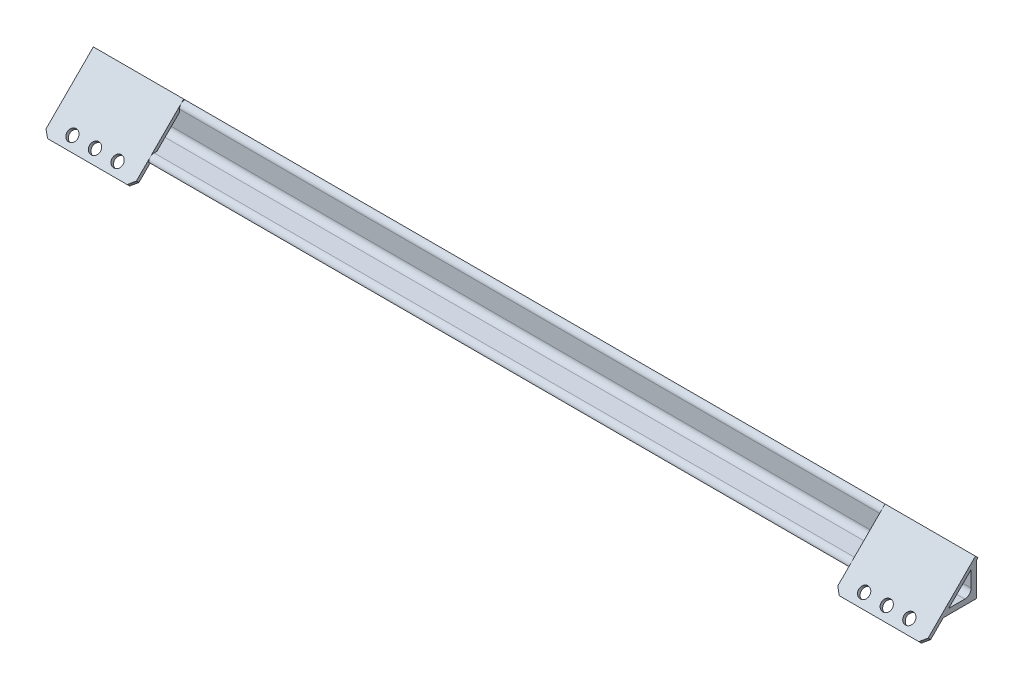
ISO-10303-21;
HEADER;
FILE_DESCRIPTION(('STEP AP214'),'2;1');
FILE_NAME('part.step','',(''),(''),'','','');
FILE_SCHEMA(('AUTOMOTIVE_DESIGN { 1 0 10303 214 1 1 1 1 }'));
ENDSEC;
DATA;
#1=APPLICATION_CONTEXT('core data for automotive mechanical design processes');
#2=APPLICATION_PROTOCOL_DEFINITION('international standard','automotive_design',2000,#1);
#3=PRODUCT_CONTEXT('',#1,'mechanical');
#4=PRODUCT('Part','Part','',(#3));
#5=PRODUCT_RELATED_PRODUCT_CATEGORY('part','',(#4));
#6=PRODUCT_DEFINITION_FORMATION('','',#4);
#7=PRODUCT_DEFINITION_CONTEXT('part definition',#1,'design');
#8=PRODUCT_DEFINITION('design','',#6,#7);
#9=PRODUCT_DEFINITION_SHAPE('','',#8);
#10=(LENGTH_UNIT() NAMED_UNIT(*) SI_UNIT(.MILLI.,.METRE.));
#11=(NAMED_UNIT(*) PLANE_ANGLE_UNIT() SI_UNIT($,.RADIAN.));
#12=(NAMED_UNIT(*) SI_UNIT($,.STERADIAN.) SOLID_ANGLE_UNIT());
#13=UNCERTAINTY_MEASURE_WITH_UNIT(LENGTH_MEASURE(1.E-05),#10,'distance_accuracy_value','');
#14=(GEOMETRIC_REPRESENTATION_CONTEXT(3) GLOBAL_UNCERTAINTY_ASSIGNED_CONTEXT((#13)) GLOBAL_UNIT_ASSIGNED_CONTEXT((#10,
#11,#12)) REPRESENTATION_CONTEXT('',''));
#15=CARTESIAN_POINT('',(0.,0.,0.));
#16=DIRECTION('',(0.,0.,1.));
#17=DIRECTION('',(1.,0.,0.));
#18=AXIS2_PLACEMENT_3D('',#15,#16,#17);
#19=CARTESIAN_POINT('',(-194.,19.2071067811865,-0.79289321881339));
#20=DIRECTION('',(1.,0.,0.));
#21=DIRECTION('',(0.,0.,-1.));
#22=AXIS2_PLACEMENT_3D('',#19,#20,#21);
#23=PLANE('',#22);
#24=DIRECTION('',(0.,0.707106781186547,-0.707106781186548));
#25=VECTOR('',#24,1.);
#26=CARTESIAN_POINT('',(-194.,20.6213203435596,0.621320343559705));
#27=LINE('',#26,#25);
#28=CARTESIAN_POINT('',(-194.,-5.57106781186553,26.8137084989848));
#29=VERTEX_POINT('',#28);
#30=CARTESIAN_POINT('',(-194.,20.6213203435596,0.621320343559705));
#31=VERTEX_POINT('',#30);
#32=EDGE_CURVE('E146',#29,#31,#27,.T.);
#33=ORIENTED_EDGE('',*,*,#32,.F.);
#34=DIRECTION('',(0.,-0.707106781186548,-0.707106781186547));
#35=VECTOR('',#34,1.);
#36=CARTESIAN_POINT('',(-194.,-6.98528137423862,25.3994949366117));
#37=LINE('',#36,#35);
#38=CARTESIAN_POINT('',(-194.,-6.98528137423862,25.3994949366117));
#39=VERTEX_POINT('',#38);
#40=EDGE_CURVE('E14',#29,#39,#37,.T.);
#41=ORIENTED_EDGE('',*,*,#40,.T.);
#42=DIRECTION('',(0.,0.707106781186547,-0.707106781186548));
#43=VECTOR('',#42,1.);
#44=CARTESIAN_POINT('',(-194.,19.2071067811865,-0.79289321881339));
#45=LINE('',#44,#43);
#46=CARTESIAN_POINT('',(-194.,19.2071067811865,-0.79289321881339));
#47=VERTEX_POINT('',#46);
#48=EDGE_CURVE('E121',#39,#47,#45,.T.);
#49=ORIENTED_EDGE('',*,*,#48,.T.);
#50=DIRECTION('',(0.,0.707106781186548,0.707106781186547));
#51=VECTOR('',#50,1.);
#52=CARTESIAN_POINT('',(-194.,19.2071067811865,-0.79289321881339));
#53=LINE('',#52,#51);
#54=EDGE_CURVE('E123',#47,#31,#53,.T.);
#55=ORIENTED_EDGE('',*,*,#54,.T.);
#56=EDGE_LOOP('',(#33,#41,#49,#55));
#57=FACE_BOUND('',#56,.T.);
#58=ADVANCED_FACE('F70',(#57),#23,.T.);
#59=CARTESIAN_POINT('',(-244.,-9.10660171779825,27.5208152801714));
#60=DIRECTION('',(0.,-0.707106781186547,0.707106781186548));
#61=DIRECTION('',(0.,-0.707106781186548,-0.707106781186547));
#62=AXIS2_PLACEMENT_3D('',#59,#60,#61);
#63=PLANE('',#62);
#64=DIRECTION('',(1.,0.,0.));
#65=VECTOR('',#64,1.);
#66=CARTESIAN_POINT('',(-244.,-7.69238815542516,28.9350288425445));
#67=LINE('',#66,#65);
#68=CARTESIAN_POINT('',(-241.,-7.69238815542516,28.9350288425445));
#69=VERTEX_POINT('',#68);
#70=CARTESIAN_POINT('',(-197.,-7.69238815542516,28.9350288425445));
#71=VERTEX_POINT('',#70);
#72=EDGE_CURVE('E127',#69,#71,#67,.T.);
#73=ORIENTED_EDGE('',*,*,#72,.F.);
#74=DIRECTION('',(0.,-0.707106781186548,-0.707106781186547));
#75=VECTOR('',#74,1.);
#76=CARTESIAN_POINT('',(-241.,-9.10660171779825,27.5208152801714));
#77=LINE('',#76,#75);
#78=CARTESIAN_POINT('',(-241.,-9.10660171779825,27.5208152801714));
#79=VERTEX_POINT('',#78);
#80=EDGE_CURVE('E166',#69,#79,#77,.T.);
#81=ORIENTED_EDGE('',*,*,#80,.T.);
#82=DIRECTION('',(1.,0.,0.));
#83=VECTOR('',#82,1.);
#84=CARTESIAN_POINT('',(-244.,-9.10660171779825,27.5208152801714));
#85=LINE('',#84,#83);
#86=CARTESIAN_POINT('',(-197.,-9.10660171779825,27.5208152801714));
#87=VERTEX_POINT('',#86);
#88=EDGE_CURVE('E135',#79,#87,#85,.T.);
#89=ORIENTED_EDGE('',*,*,#88,.T.);
#90=DIRECTION('',(0.,0.707106781186548,0.707106781186547));
#91=VECTOR('',#90,1.);
#92=CARTESIAN_POINT('',(-197.,-9.10660171779825,27.5208152801714));
#93=LINE('',#92,#91);
#94=EDGE_CURVE('E163',#87,#71,#93,.T.);
#95=ORIENTED_EDGE('',*,*,#94,.T.);
#96=EDGE_LOOP('',(#73,#81,#89,#95));
#97=FACE_BOUND('',#96,.T.);
#98=ADVANCED_FACE('F180',(#97),#63,.T.);
#99=CARTESIAN_POINT('',(-244.,19.2071067811865,-0.792893218813454));
#100=DIRECTION('',(-1.,0.,0.));
#101=DIRECTION('',(0.,0.,1.));
#102=AXIS2_PLACEMENT_3D('',#99,#100,#101);
#103=PLANE('',#102);
#104=DIRECTION('',(0.,-0.707106781186547,0.707106781186548));
#105=VECTOR('',#104,1.);
#106=CARTESIAN_POINT('',(-244.,19.2071067811865,-0.792893218813454));
#107=LINE('',#106,#105);
#108=CARTESIAN_POINT('',(-244.,19.2071067811865,-0.792893218813454));
#109=VERTEX_POINT('',#108);
#110=CARTESIAN_POINT('',(-244.,-6.98528137423861,25.3994949366117));
#111=VERTEX_POINT('',#110);
#112=EDGE_CURVE('E140',#109,#111,#107,.T.);
#113=ORIENTED_EDGE('',*,*,#112,.T.);
#114=DIRECTION('',(0.,0.707106781186548,0.707106781186547));
#115=VECTOR('',#114,1.);
#116=CARTESIAN_POINT('',(-244.,-6.98528137423861,25.3994949366117));
#117=LINE('',#116,#115);
#118=CARTESIAN_POINT('',(-244.,-5.57106781186552,26.8137084989848));
#119=VERTEX_POINT('',#118);
#120=EDGE_CURVE('E155',#111,#119,#117,.T.);
#121=ORIENTED_EDGE('',*,*,#120,.T.);
#122=DIRECTION('',(0.,-0.707106781186547,0.707106781186548));
#123=VECTOR('',#122,1.);
#124=CARTESIAN_POINT('',(-244.,20.6213203435596,0.621320343559641));
#125=LINE('',#124,#123);
#126=CARTESIAN_POINT('',(-244.,20.6213203435596,0.621320343559641));
#127=VERTEX_POINT('',#126);
#128=EDGE_CURVE('E150',#127,#119,#125,.T.);
#129=ORIENTED_EDGE('',*,*,#128,.F.);
#130=DIRECTION('',(0.,0.707106781186548,0.707106781186547));
#131=VECTOR('',#130,1.);
#132=CARTESIAN_POINT('',(-244.,19.2071067811865,-0.792893218813454));
#133=LINE('',#132,#131);
#134=EDGE_CURVE('E134',#109,#127,#133,.T.);
#135=ORIENTED_EDGE('',*,*,#134,.F.);
#136=EDGE_LOOP('',(#113,#121,#129,#135));
#137=FACE_BOUND('',#136,.T.);
#138=ADVANCED_FACE('F173',(#137),#103,.T.);
#139=CARTESIAN_POINT('',(-244.,19.2071067811865,-0.792893218813454));
#140=DIRECTION('',(0.,0.707106781186547,-0.707106781186548));
#141=DIRECTION('',(0.,0.707106781186548,0.707106781186547));
#142=AXIS2_PLACEMENT_3D('',#139,#140,#141);
#143=PLANE('',#142);
#144=DIRECTION('',(-1.,0.,0.));
#145=VECTOR('',#144,1.);
#146=CARTESIAN_POINT('',(-244.,20.6213203435596,0.621320343559641));
#147=LINE('',#146,#145);
#148=EDGE_CURVE('E133',#31,#127,#147,.T.);
#149=ORIENTED_EDGE('',*,*,#148,.F.);
#150=ORIENTED_EDGE('',*,*,#54,.F.);
#151=DIRECTION('',(-1.,0.,0.));
#152=VECTOR('',#151,1.);
#153=CARTESIAN_POINT('',(-244.,19.2071067811865,-0.792893218813454));
#154=LINE('',#153,#152);
#155=EDGE_CURVE('E126',#47,#109,#154,.T.);
#156=ORIENTED_EDGE('',*,*,#155,.T.);
#157=ORIENTED_EDGE('',*,*,#134,.T.);
#158=EDGE_LOOP('',(#149,#150,#156,#157));
#159=FACE_BOUND('',#158,.T.);
#160=ADVANCED_FACE('F131',(#159),#143,.T.);
#161=CARTESIAN_POINT('',(0.,9.20710678118655,9.20710678118655));
#162=DIRECTION('',(0.,0.707106781186548,0.707106781186547));
#163=DIRECTION('',(0.,-0.707106781186547,0.707106781186548));
#164=AXIS2_PLACEMENT_3D('',#161,#162,#163);
#165=PLANE('',#164);
#166=CARTESIAN_POINT('',(-231.5,-4.86396103067909,23.2781745930522));
#167=DIRECTION('',(0.,0.707106781186548,0.707106781186547));
#168=DIRECTION('',(0.,-0.707106781186547,0.707106781186548));
#169=AXIS2_PLACEMENT_3D('',#166,#167,#168);
#170=CIRCLE('',#169,2.99999999999999);
#171=CARTESIAN_POINT('',(-231.5,-6.98528137423873,25.3994949366118));
#172=VERTEX_POINT('',#171);
#173=EDGE_CURVE('E220',#172,#172,#170,.T.);
#174=ORIENTED_EDGE('',*,*,#173,.T.);
#175=EDGE_LOOP('',(#174));
#176=FACE_BOUND('',#175,.T.);
#177=CARTESIAN_POINT('',(-219.,-4.86396103067903,23.2781745930521));
#178=DIRECTION('',(0.,0.707106781186548,0.707106781186547));
#179=DIRECTION('',(0.,-0.707106781186547,0.707106781186548));
#180=AXIS2_PLACEMENT_3D('',#177,#178,#179);
#181=CIRCLE('',#180,3.);
#182=CARTESIAN_POINT('',(-219.,-6.98528137423867,25.3994949366118));
#183=VERTEX_POINT('',#182);
#184=EDGE_CURVE('E228',#183,#183,#181,.T.);
#185=ORIENTED_EDGE('',*,*,#184,.T.);
#186=EDGE_LOOP('',(#185));
#187=FACE_BOUND('',#186,.T.);
#188=CARTESIAN_POINT('',(-206.5,-4.86396103067897,23.2781745930521));
#189=DIRECTION('',(0.,0.707106781186548,0.707106781186547));
#190=DIRECTION('',(0.,-0.707106781186547,0.707106781186548));
#191=AXIS2_PLACEMENT_3D('',#188,#189,#190);
#192=CIRCLE('',#191,2.99999999999999);
#193=CARTESIAN_POINT('',(-206.5,-6.98528137423861,25.3994949366117));
#194=VERTEX_POINT('',#193);
#195=EDGE_CURVE('E148',#194,#194,#192,.T.);
#196=ORIENTED_EDGE('',*,*,#195,.T.);
#197=EDGE_LOOP('',(#196));
#198=FACE_BOUND('',#197,.T.);
#199=ORIENTED_EDGE('',*,*,#88,.F.);
#200=DIRECTION('',(0.707106781186547,-0.5,0.5));
#201=VECTOR('',#200,1.);
#202=CARTESIAN_POINT('',(-244.,-6.98528137423861,25.3994949366117));
#203=LINE('',#202,#201);
#204=EDGE_CURVE('E78',#79,#111,#203,.F.);
#205=ORIENTED_EDGE('',*,*,#204,.T.);
#206=ORIENTED_EDGE('',*,*,#112,.F.);
#207=ORIENTED_EDGE('',*,*,#155,.F.);
#208=ORIENTED_EDGE('',*,*,#48,.F.);
#209=DIRECTION('',(0.707106781186549,0.499999999999999,-0.499999999999999));
#210=VECTOR('',#209,1.);
#211=CARTESIAN_POINT('',(-197.,-9.10660171779825,27.5208152801714));
#212=LINE('',#211,#210);
#213=EDGE_CURVE('E90',#39,#87,#212,.F.);
#214=ORIENTED_EDGE('',*,*,#213,.T.);
#215=EDGE_LOOP('',(#199,#205,#206,#207,#208,#214));
#216=FACE_BOUND('',#215,.T.);
#217=ADVANCED_FACE('F138',(#176,#187,#198,#216),#165,.F.);
#218=CARTESIAN_POINT('',(0.,10.6213203435596,10.6213203435596));
#219=DIRECTION('',(0.,0.707106781186548,0.707106781186547));
#220=DIRECTION('',(0.,-0.707106781186547,0.707106781186548));
#221=AXIS2_PLACEMENT_3D('',#218,#219,#220);
#222=PLANE('',#221);
#223=CARTESIAN_POINT('',(-231.5,-3.449747468306,24.6923881554253));
#224=DIRECTION('',(0.,0.707106781186548,0.707106781186547));
#225=DIRECTION('',(0.,-0.707106781186547,0.707106781186548));
#226=AXIS2_PLACEMENT_3D('',#223,#224,#225);
#227=CIRCLE('',#226,2.99999999999999);
#228=CARTESIAN_POINT('',(-231.5,-5.57106781186564,26.8137084989849));
#229=VERTEX_POINT('',#228);
#230=EDGE_CURVE('E223',#229,#229,#227,.T.);
#231=ORIENTED_EDGE('',*,*,#230,.F.);
#232=EDGE_LOOP('',(#231));
#233=FACE_BOUND('',#232,.T.);
#234=CARTESIAN_POINT('',(-219.,-3.44974746830594,24.6923881554252));
#235=DIRECTION('',(0.,0.707106781186548,0.707106781186547));
#236=DIRECTION('',(0.,-0.707106781186547,0.707106781186548));
#237=AXIS2_PLACEMENT_3D('',#234,#235,#236);
#238=CIRCLE('',#237,3.);
#239=CARTESIAN_POINT('',(-219.,-5.57106781186558,26.8137084989849));
#240=VERTEX_POINT('',#239);
#241=EDGE_CURVE('E225',#240,#240,#238,.T.);
#242=ORIENTED_EDGE('',*,*,#241,.F.);
#243=EDGE_LOOP('',(#242));
#244=FACE_BOUND('',#243,.T.);
#245=CARTESIAN_POINT('',(-206.5,-3.44974746830587,24.6923881554252));
#246=DIRECTION('',(0.,0.707106781186548,0.707106781186547));
#247=DIRECTION('',(0.,-0.707106781186547,0.707106781186548));
#248=AXIS2_PLACEMENT_3D('',#245,#246,#247);
#249=CIRCLE('',#248,2.99999999999999);
#250=CARTESIAN_POINT('',(-206.5,-5.57106781186551,26.8137084989848));
#251=VERTEX_POINT('',#250);
#252=EDGE_CURVE('E231',#251,#251,#249,.T.);
#253=ORIENTED_EDGE('',*,*,#252,.F.);
#254=EDGE_LOOP('',(#253));
#255=FACE_BOUND('',#254,.T.);
#256=ORIENTED_EDGE('',*,*,#128,.T.);
#257=DIRECTION('',(-0.707106781186547,0.5,-0.5));
#258=VECTOR('',#257,1.);
#259=CARTESIAN_POINT('',(-133.449747468306,-83.7419010389117,104.984541726031));
#260=LINE('',#259,#258);
#261=EDGE_CURVE('E161',#119,#69,#260,.F.);
#262=ORIENTED_EDGE('',*,*,#261,.T.);
#263=ORIENTED_EDGE('',*,*,#72,.T.);
#264=DIRECTION('',(-0.707106781186549,-0.499999999999999,0.499999999999999));
#265=VECTOR('',#264,1.);
#266=CARTESIAN_POINT('',(-85.5502525316938,71.1144840409421,-49.8718433538229));
#267=LINE('',#266,#265);
#268=EDGE_CURVE('E159',#71,#29,#267,.F.);
#269=ORIENTED_EDGE('',*,*,#268,.T.);
#270=ORIENTED_EDGE('',*,*,#32,.T.);
#271=ORIENTED_EDGE('',*,*,#148,.T.);
#272=EDGE_LOOP('',(#256,#262,#263,#269,#270,#271));
#273=FACE_BOUND('',#272,.T.);
#274=ADVANCED_FACE('F178',(#233,#244,#255,#273),#222,.T.);
#275=CARTESIAN_POINT('',(-206.5,-4.86396103067897,23.2781745930521));
#276=DIRECTION('',(0.,0.707106781186548,0.707106781186547));
#277=DIRECTION('',(0.,-0.707106781186547,0.707106781186548));
#278=AXIS2_PLACEMENT_3D('',#275,#276,#277);
#279=CYLINDRICAL_SURFACE('',#278,2.99999999999999);
#280=ORIENTED_EDGE('',*,*,#195,.F.);
#281=EDGE_LOOP('',(#280));
#282=FACE_BOUND('',#281,.T.);
#283=ORIENTED_EDGE('',*,*,#252,.T.);
#284=EDGE_LOOP('',(#283));
#285=FACE_BOUND('',#284,.T.);
#286=ADVANCED_FACE('F201',(#282,#285),#279,.F.);
#287=CARTESIAN_POINT('',(-219.,-4.86396103067903,23.2781745930521));
#288=DIRECTION('',(0.,0.707106781186548,0.707106781186547));
#289=DIRECTION('',(0.,-0.707106781186547,0.707106781186548));
#290=AXIS2_PLACEMENT_3D('',#287,#288,#289);
#291=CYLINDRICAL_SURFACE('',#290,3.);
#292=ORIENTED_EDGE('',*,*,#184,.F.);
#293=EDGE_LOOP('',(#292));
#294=FACE_BOUND('',#293,.T.);
#295=ORIENTED_EDGE('',*,*,#241,.T.);
#296=EDGE_LOOP('',(#295));
#297=FACE_BOUND('',#296,.T.);
#298=ADVANCED_FACE('F208',(#294,#297),#291,.F.);
#299=CARTESIAN_POINT('',(-231.5,-4.86396103067909,23.2781745930522));
#300=DIRECTION('',(0.,0.707106781186548,0.707106781186547));
#301=DIRECTION('',(0.,-0.707106781186547,0.707106781186548));
#302=AXIS2_PLACEMENT_3D('',#299,#300,#301);
#303=CYLINDRICAL_SURFACE('',#302,2.99999999999999);
#304=ORIENTED_EDGE('',*,*,#173,.F.);
#305=EDGE_LOOP('',(#304));
#306=FACE_BOUND('',#305,.T.);
#307=ORIENTED_EDGE('',*,*,#230,.T.);
#308=EDGE_LOOP('',(#307));
#309=FACE_BOUND('',#308,.T.);
#310=ADVANCED_FACE('F187',(#306,#309),#303,.F.);
#311=CARTESIAN_POINT('',(-244.,-6.98528137423861,25.3994949366117));
#312=DIRECTION('',(0.707106781186548,0.5,-0.5));
#313=DIRECTION('',(0.,0.707106781186548,0.707106781186547));
#314=AXIS2_PLACEMENT_3D('',#311,#312,#313);
#315=PLANE('',#314);
#316=ORIENTED_EDGE('',*,*,#204,.F.);
#317=ORIENTED_EDGE('',*,*,#80,.F.);
#318=ORIENTED_EDGE('',*,*,#261,.F.);
#319=ORIENTED_EDGE('',*,*,#120,.F.);
#320=EDGE_LOOP('',(#316,#317,#318,#319));
#321=FACE_BOUND('',#320,.T.);
#322=ADVANCED_FACE('F175',(#321),#315,.F.);
#323=CARTESIAN_POINT('',(-197.,-9.10660171779825,27.5208152801714));
#324=DIRECTION('',(-0.707106781186546,0.500000000000001,-0.500000000000001));
#325=DIRECTION('',(0.,0.707106781186548,0.707106781186547));
#326=AXIS2_PLACEMENT_3D('',#323,#324,#325);
#327=PLANE('',#326);
#328=ORIENTED_EDGE('',*,*,#213,.F.);
#329=ORIENTED_EDGE('',*,*,#40,.F.);
#330=ORIENTED_EDGE('',*,*,#268,.F.);
#331=ORIENTED_EDGE('',*,*,#94,.F.);
#332=EDGE_LOOP('',(#328,#329,#330,#331));
#333=FACE_BOUND('',#332,.T.);
#334=ADVANCED_FACE('F72',(#333),#327,.F.);
#335=CLOSED_SHELL('',(#58,#98,#138,#160,#217,#274,#286,#298,#310,#322,#334));
#336=MANIFOLD_SOLID_BREP('B2',#335);
#337=CARTESIAN_POINT('',(244.,20.,0.));
#338=DIRECTION('',(0.,0.,1.));
#339=DIRECTION('',(1.,0.,0.));
#340=AXIS2_PLACEMENT_3D('',#337,#338,#339);
#341=PLANE('',#340);
#342=DIRECTION('',(-1.,0.,0.));
#343=VECTOR('',#342,1.);
#344=CARTESIAN_POINT('',(244.,20.,0.));
#345=LINE('',#344,#343);
#346=CARTESIAN_POINT('',(194.,20.,0.));
#347=VERTEX_POINT('',#346);
#348=CARTESIAN_POINT('',(-244.,20.,0.));
#349=VERTEX_POINT('',#348);
#350=EDGE_CURVE('E315',#347,#349,#345,.T.);
#351=ORIENTED_EDGE('',*,*,#350,.F.);
#352=DIRECTION('',(0.,-1.,0.));
#353=VECTOR('',#352,1.);
#354=CARTESIAN_POINT('',(194.,20.,0.));
#355=LINE('',#354,#353);
#356=CARTESIAN_POINT('',(194.,18.4142135623731,0.));
#357=VERTEX_POINT('',#356);
#358=EDGE_CURVE('E322',#347,#357,#355,.T.);
#359=ORIENTED_EDGE('',*,*,#358,.T.);
#360=DIRECTION('',(-1.,0.,0.));
#361=VECTOR('',#360,1.);
#362=CARTESIAN_POINT('',(244.,18.4142135623731,0.));
#363=LINE('',#362,#361);
#364=CARTESIAN_POINT('',(244.,18.4142135623731,0.));
#365=VERTEX_POINT('',#364);
#366=EDGE_CURVE('E519',#365,#357,#363,.T.);
#367=ORIENTED_EDGE('',*,*,#366,.F.);
#368=DIRECTION('',(0.,1.,0.));
#369=VECTOR('',#368,1.);
#370=CARTESIAN_POINT('',(244.,20.,0.));
#371=LINE('',#370,#369);
#372=CARTESIAN_POINT('',(244.,0.,0.));
#373=VERTEX_POINT('',#372);
#374=EDGE_CURVE('E531',#373,#365,#371,.T.);
#375=ORIENTED_EDGE('',*,*,#374,.F.);
#376=DIRECTION('',(-1.,0.,0.));
#377=VECTOR('',#376,1.);
#378=CARTESIAN_POINT('',(244.,0.,0.));
#379=LINE('',#378,#377);
#380=CARTESIAN_POINT('',(-244.,0.,0.));
#381=VERTEX_POINT('',#380);
#382=EDGE_CURVE('E544',#373,#381,#379,.T.);
#383=ORIENTED_EDGE('',*,*,#382,.T.);
#384=DIRECTION('',(0.,1.,0.));
#385=VECTOR('',#384,1.);
#386=CARTESIAN_POINT('',(-244.,20.,0.));
#387=LINE('',#386,#385);
#388=EDGE_CURVE('E530',#381,#349,#387,.T.);
#389=ORIENTED_EDGE('',*,*,#388,.T.);
#390=EDGE_LOOP('',(#351,#359,#367,#375,#383,#389));
#391=FACE_BOUND('',#390,.T.);
#392=ADVANCED_FACE('F308',(#391),#341,.F.);
#393=CARTESIAN_POINT('',(244.,17.,0.));
#394=DIRECTION('',(-1.,0.,0.));
#395=DIRECTION('',(0.,0.,1.));
#396=AXIS2_PLACEMENT_3D('',#393,#394,#395);
#397=CYLINDRICAL_SURFACE('',#396,3.);
#398=CARTESIAN_POINT('',(194.,17.,0.));
#399=DIRECTION('',(-1.,0.,0.));
#400=DIRECTION('',(0.,0.,1.));
#401=AXIS2_PLACEMENT_3D('',#398,#399,#400);
#402=CIRCLE('',#401,3.);
#403=CARTESIAN_POINT('',(194.,17.,3.));
#404=VERTEX_POINT('',#403);
#405=CARTESIAN_POINT('',(194.,19.1213203435596,2.12132034355964));
#406=VERTEX_POINT('',#405);
#407=EDGE_CURVE('E330',#404,#406,#402,.T.);
#408=ORIENTED_EDGE('',*,*,#407,.T.);
#409=EDGE_CURVE('E472',#406,#347,#402,.T.);
#410=ORIENTED_EDGE('',*,*,#409,.T.);
#411=ORIENTED_EDGE('',*,*,#350,.T.);
#412=CARTESIAN_POINT('',(-244.,17.,0.));
#413=DIRECTION('',(1.,0.,0.));
#414=DIRECTION('',(0.,0.,-1.));
#415=AXIS2_PLACEMENT_3D('',#412,#413,#414);
#416=CIRCLE('',#415,3.);
#417=CARTESIAN_POINT('',(-244.,17.,3.));
#418=VERTEX_POINT('',#417);
#419=EDGE_CURVE('E547',#349,#418,#416,.T.);
#420=ORIENTED_EDGE('',*,*,#419,.T.);
#421=DIRECTION('',(-1.,0.,0.));
#422=VECTOR('',#421,1.);
#423=CARTESIAN_POINT('',(244.,17.,3.));
#424=LINE('',#423,#422);
#425=EDGE_CURVE('E573',#404,#418,#424,.T.);
#426=ORIENTED_EDGE('',*,*,#425,.F.);
#427=EDGE_LOOP('',(#408,#410,#411,#420,#426));
#428=FACE_BOUND('',#427,.T.);
#429=ADVANCED_FACE('F575',(#428),#397,.T.);
#430=CARTESIAN_POINT('',(244.,6.5,3.));
#431=DIRECTION('',(0.,0.,-1.));
#432=DIRECTION('',(-1.,0.,0.));
#433=AXIS2_PLACEMENT_3D('',#430,#431,#432);
#434=PLANE('',#433);
#435=DIRECTION('',(1.,0.,0.));
#436=VECTOR('',#435,1.);
#437=CARTESIAN_POINT('',(244.,15.4142135623731,3.));
#438=LINE('',#437,#436);
#439=CARTESIAN_POINT('',(194.,15.4142135623731,3.));
#440=VERTEX_POINT('',#439);
#441=CARTESIAN_POINT('',(244.,15.4142135623731,2.99999999999999));
#442=VERTEX_POINT('',#441);
#443=EDGE_CURVE('E516',#440,#442,#438,.T.);
#444=ORIENTED_EDGE('',*,*,#443,.F.);
#445=DIRECTION('',(0.,1.,0.));
#446=VECTOR('',#445,1.);
#447=CARTESIAN_POINT('',(194.,6.5,3.));
#448=LINE('',#447,#446);
#449=EDGE_CURVE('E526',#440,#404,#448,.T.);
#450=ORIENTED_EDGE('',*,*,#449,.T.);
#451=ORIENTED_EDGE('',*,*,#425,.T.);
#452=DIRECTION('',(0.,-1.,0.));
#453=VECTOR('',#452,1.);
#454=CARTESIAN_POINT('',(-244.,6.5,3.));
#455=LINE('',#454,#453);
#456=CARTESIAN_POINT('',(-244.,6.5,3.));
#457=VERTEX_POINT('',#456);
#458=EDGE_CURVE('E550',#418,#457,#455,.T.);
#459=ORIENTED_EDGE('',*,*,#458,.T.);
#460=DIRECTION('',(-1.,0.,0.));
#461=VECTOR('',#460,1.);
#462=CARTESIAN_POINT('',(244.,6.5,3.));
#463=LINE('',#462,#461);
#464=CARTESIAN_POINT('',(244.,6.5,3.));
#465=VERTEX_POINT('',#464);
#466=EDGE_CURVE('E570',#465,#457,#463,.T.);
#467=ORIENTED_EDGE('',*,*,#466,.F.);
#468=DIRECTION('',(0.,-1.,0.));
#469=VECTOR('',#468,1.);
#470=CARTESIAN_POINT('',(244.,6.5,3.));
#471=LINE('',#470,#469);
#472=EDGE_CURVE('E534',#442,#465,#471,.T.);
#473=ORIENTED_EDGE('',*,*,#472,.F.);
#474=EDGE_LOOP('',(#444,#450,#451,#459,#467,#473));
#475=FACE_BOUND('',#474,.T.);
#476=ADVANCED_FACE('F603',(#475),#434,.F.);
#477=CARTESIAN_POINT('',(244.,6.5,6.5));
#478=DIRECTION('',(-1.,0.,0.));
#479=DIRECTION('',(0.,0.,1.));
#480=AXIS2_PLACEMENT_3D('',#477,#478,#479);
#481=CYLINDRICAL_SURFACE('',#480,3.5);
#482=CARTESIAN_POINT('',(-244.,6.5,6.5));
#483=DIRECTION('',(-1.,0.,0.));
#484=DIRECTION('',(0.,0.,1.));
#485=AXIS2_PLACEMENT_3D('',#482,#483,#484);
#486=CIRCLE('',#485,3.5);
#487=CARTESIAN_POINT('',(-244.,3.,6.5));
#488=VERTEX_POINT('',#487);
#489=EDGE_CURVE('E552',#457,#488,#486,.T.);
#490=ORIENTED_EDGE('',*,*,#489,.T.);
#491=DIRECTION('',(-1.,0.,0.));
#492=VECTOR('',#491,1.);
#493=CARTESIAN_POINT('',(244.,3.,6.5));
#494=LINE('',#493,#492);
#495=CARTESIAN_POINT('',(244.,3.,6.5));
#496=VERTEX_POINT('',#495);
#497=EDGE_CURVE('E567',#496,#488,#494,.T.);
#498=ORIENTED_EDGE('',*,*,#497,.F.);
#499=CARTESIAN_POINT('',(244.,6.5,6.5));
#500=DIRECTION('',(-1.,0.,0.));
#501=DIRECTION('',(0.,0.,1.));
#502=AXIS2_PLACEMENT_3D('',#499,#500,#501);
#503=CIRCLE('',#502,3.5);
#504=EDGE_CURVE('E537',#465,#496,#503,.T.);
#505=ORIENTED_EDGE('',*,*,#504,.F.);
#506=ORIENTED_EDGE('',*,*,#466,.T.);
#507=EDGE_LOOP('',(#490,#498,#505,#506));
#508=FACE_BOUND('',#507,.T.);
#509=ADVANCED_FACE('F600',(#508),#481,.F.);
#510=CARTESIAN_POINT('',(244.,3.,17.));
#511=DIRECTION('',(0.,-1.,0.));
#512=DIRECTION('',(0.,0.,-1.));
#513=AXIS2_PLACEMENT_3D('',#510,#511,#512);
#514=PLANE('',#513);
#515=DIRECTION('',(-1.,0.,0.));
#516=VECTOR('',#515,1.);
#517=CARTESIAN_POINT('',(244.,3.,17.));
#518=LINE('',#517,#516);
#519=CARTESIAN_POINT('',(194.,3.,17.));
#520=VERTEX_POINT('',#519);
#521=CARTESIAN_POINT('',(-244.,3.,17.));
#522=VERTEX_POINT('',#521);
#523=EDGE_CURVE('E565',#520,#522,#518,.T.);
#524=ORIENTED_EDGE('',*,*,#523,.F.);
#525=DIRECTION('',(0.,0.,-1.));
#526=VECTOR('',#525,1.);
#527=CARTESIAN_POINT('',(194.,3.,17.));
#528=LINE('',#527,#526);
#529=CARTESIAN_POINT('',(194.,3.,15.4142135623731));
#530=VERTEX_POINT('',#529);
#531=EDGE_CURVE('E524',#520,#530,#528,.T.);
#532=ORIENTED_EDGE('',*,*,#531,.T.);
#533=DIRECTION('',(-1.,0.,0.));
#534=VECTOR('',#533,1.);
#535=CARTESIAN_POINT('',(244.,3.,15.4142135623731));
#536=LINE('',#535,#534);
#537=CARTESIAN_POINT('',(244.,3.,15.4142135623731));
#538=VERTEX_POINT('',#537);
#539=EDGE_CURVE('E513',#538,#530,#536,.T.);
#540=ORIENTED_EDGE('',*,*,#539,.F.);
#541=DIRECTION('',(0.,0.,1.));
#542=VECTOR('',#541,1.);
#543=CARTESIAN_POINT('',(244.,3.,17.));
#544=LINE('',#543,#542);
#545=EDGE_CURVE('E539',#496,#538,#544,.T.);
#546=ORIENTED_EDGE('',*,*,#545,.F.);
#547=ORIENTED_EDGE('',*,*,#497,.T.);
#548=DIRECTION('',(0.,0.,1.));
#549=VECTOR('',#548,1.);
#550=CARTESIAN_POINT('',(-244.,3.,17.));
#551=LINE('',#550,#549);
#552=EDGE_CURVE('E554',#488,#522,#551,.T.);
#553=ORIENTED_EDGE('',*,*,#552,.T.);
#554=EDGE_LOOP('',(#524,#532,#540,#546,#547,#553));
#555=FACE_BOUND('',#554,.T.);
#556=ADVANCED_FACE('F595',(#555),#514,.F.);
#557=CARTESIAN_POINT('',(244.,0.,17.));
#558=DIRECTION('',(-1.,0.,0.));
#559=DIRECTION('',(0.,0.,1.));
#560=AXIS2_PLACEMENT_3D('',#557,#558,#559);
#561=CYLINDRICAL_SURFACE('',#560,3.);
#562=CARTESIAN_POINT('',(194.,0.,17.));
#563=DIRECTION('',(-1.,0.,0.));
#564=DIRECTION('',(0.,0.,1.));
#565=AXIS2_PLACEMENT_3D('',#562,#563,#564);
#566=CIRCLE('',#565,3.);
#567=CARTESIAN_POINT('',(194.,0.,20.));
#568=VERTEX_POINT('',#567);
#569=CARTESIAN_POINT('',(194.,2.12132034355964,19.1213203435596));
#570=VERTEX_POINT('',#569);
#571=EDGE_CURVE('E521',#568,#570,#566,.T.);
#572=ORIENTED_EDGE('',*,*,#571,.T.);
#573=EDGE_CURVE('E523',#570,#520,#566,.T.);
#574=ORIENTED_EDGE('',*,*,#573,.T.);
#575=ORIENTED_EDGE('',*,*,#523,.T.);
#576=CARTESIAN_POINT('',(-244.,0.,17.));
#577=DIRECTION('',(1.,0.,0.));
#578=DIRECTION('',(0.,0.,1.));
#579=AXIS2_PLACEMENT_3D('',#576,#577,#578);
#580=CIRCLE('',#579,3.);
#581=CARTESIAN_POINT('',(-244.,0.,20.));
#582=VERTEX_POINT('',#581);
#583=EDGE_CURVE('E557',#522,#582,#580,.T.);
#584=ORIENTED_EDGE('',*,*,#583,.T.);
#585=DIRECTION('',(-1.,0.,0.));
#586=VECTOR('',#585,1.);
#587=CARTESIAN_POINT('',(244.,0.,20.));
#588=LINE('',#587,#586);
#589=EDGE_CURVE('E563',#568,#582,#588,.T.);
#590=ORIENTED_EDGE('',*,*,#589,.F.);
#591=EDGE_LOOP('',(#572,#574,#575,#584,#590));
#592=FACE_BOUND('',#591,.T.);
#593=ADVANCED_FACE('F590',(#592),#561,.T.);
#594=CARTESIAN_POINT('',(244.,0.,0.));
#595=DIRECTION('',(0.,1.,0.));
#596=DIRECTION('',(0.,0.,1.));
#597=AXIS2_PLACEMENT_3D('',#594,#595,#596);
#598=PLANE('',#597);
#599=DIRECTION('',(1.,0.,0.));
#600=VECTOR('',#599,1.);
#601=CARTESIAN_POINT('',(244.,0.,18.4142135623731));
#602=LINE('',#601,#600);
#603=CARTESIAN_POINT('',(194.,0.,18.4142135623731));
#604=VERTEX_POINT('',#603);
#605=CARTESIAN_POINT('',(244.,0.,18.4142135623731));
#606=VERTEX_POINT('',#605);
#607=EDGE_CURVE('E444',#604,#606,#602,.T.);
#608=ORIENTED_EDGE('',*,*,#607,.F.);
#609=DIRECTION('',(0.,0.,1.));
#610=VECTOR('',#609,1.);
#611=CARTESIAN_POINT('',(194.,0.,0.));
#612=LINE('',#611,#610);
#613=EDGE_CURVE('E68',#604,#568,#612,.T.);
#614=ORIENTED_EDGE('',*,*,#613,.T.);
#615=ORIENTED_EDGE('',*,*,#589,.T.);
#616=DIRECTION('',(0.,0.,-1.));
#617=VECTOR('',#616,1.);
#618=CARTESIAN_POINT('',(-244.,0.,0.));
#619=LINE('',#618,#617);
#620=EDGE_CURVE('E535',#582,#381,#619,.T.);
#621=ORIENTED_EDGE('',*,*,#620,.T.);
#622=ORIENTED_EDGE('',*,*,#382,.F.);
#623=DIRECTION('',(0.,0.,-1.));
#624=VECTOR('',#623,1.);
#625=CARTESIAN_POINT('',(244.,0.,0.));
#626=LINE('',#625,#624);
#627=EDGE_CURVE('E542',#606,#373,#626,.T.);
#628=ORIENTED_EDGE('',*,*,#627,.F.);
#629=EDGE_LOOP('',(#608,#614,#615,#621,#622,#628));
#630=FACE_BOUND('',#629,.T.);
#631=ADVANCED_FACE('F585',(#630),#598,.F.);
#632=CARTESIAN_POINT('',(244.,0.,17.));
#633=DIRECTION('',(-1.,0.,0.));
#634=DIRECTION('',(0.,0.,1.));
#635=AXIS2_PLACEMENT_3D('',#632,#633,#634);
#636=PLANE('',#635);
#637=DIRECTION('',(0.,-0.707106781186547,0.707106781186548));
#638=VECTOR('',#637,1.);
#639=CARTESIAN_POINT('',(244.,19.2071067811865,-0.792893218813454));
#640=LINE('',#639,#638);
#641=EDGE_CURVE('E614',#442,#538,#640,.T.);
#642=ORIENTED_EDGE('',*,*,#641,.F.);
#643=ORIENTED_EDGE('',*,*,#472,.T.);
#644=ORIENTED_EDGE('',*,*,#504,.T.);
#645=ORIENTED_EDGE('',*,*,#545,.T.);
#646=EDGE_LOOP('',(#642,#643,#644,#645));
#647=FACE_BOUND('',#646,.T.);
#648=ORIENTED_EDGE('',*,*,#374,.T.);
#649=CARTESIAN_POINT('',(244.,19.2071067811865,-0.792893218813454));
#650=VERTEX_POINT('',#649);
#651=EDGE_CURVE('E616',#650,#365,#640,.T.);
#652=ORIENTED_EDGE('',*,*,#651,.F.);
#653=DIRECTION('',(0.,0.707106781186548,0.707106781186547));
#654=VECTOR('',#653,1.);
#655=CARTESIAN_POINT('',(244.,19.2071067811865,-0.792893218813454));
#656=LINE('',#655,#654);
#657=CARTESIAN_POINT('',(244.,20.6213203435596,0.621320343559641));
#658=VERTEX_POINT('',#657);
#659=EDGE_CURVE('E481',#650,#658,#656,.T.);
#660=ORIENTED_EDGE('',*,*,#659,.T.);
#661=DIRECTION('',(0.,-0.707106781186547,0.707106781186548));
#662=VECTOR('',#661,1.);
#663=CARTESIAN_POINT('',(244.,20.6213203435596,0.621320343559641));
#664=LINE('',#663,#662);
#665=CARTESIAN_POINT('',(244.,-5.57106781186552,26.8137084989848));
#666=VERTEX_POINT('',#665);
#667=EDGE_CURVE('E477',#658,#666,#664,.T.);
#668=ORIENTED_EDGE('',*,*,#667,.T.);
#669=DIRECTION('',(0.,0.707106781186548,0.707106781186547));
#670=VECTOR('',#669,1.);
#671=CARTESIAN_POINT('',(244.,-6.98528137423861,25.3994949366117));
#672=LINE('',#671,#670);
#673=CARTESIAN_POINT('',(244.,-6.98528137423861,25.3994949366117));
#674=VERTEX_POINT('',#673);
#675=EDGE_CURVE('E620',#674,#666,#672,.T.);
#676=ORIENTED_EDGE('',*,*,#675,.F.);
#677=EDGE_CURVE('E617',#606,#674,#640,.T.);
#678=ORIENTED_EDGE('',*,*,#677,.F.);
#679=ORIENTED_EDGE('',*,*,#627,.T.);
#680=EDGE_LOOP('',(#648,#652,#660,#668,#676,#678,#679));
#681=FACE_BOUND('',#680,.T.);
#682=ADVANCED_FACE('F627',(#647,#681),#636,.F.);
#683=CARTESIAN_POINT('',(-244.,0.,17.));
#684=DIRECTION('',(-1.,0.,0.));
#685=DIRECTION('',(0.,0.,1.));
#686=AXIS2_PLACEMENT_3D('',#683,#684,#685);
#687=PLANE('',#686);
#688=ORIENTED_EDGE('',*,*,#388,.F.);
#689=ORIENTED_EDGE('',*,*,#620,.F.);
#690=ORIENTED_EDGE('',*,*,#583,.F.);
#691=ORIENTED_EDGE('',*,*,#552,.F.);
#692=ORIENTED_EDGE('',*,*,#489,.F.);
#693=ORIENTED_EDGE('',*,*,#458,.F.);
#694=ORIENTED_EDGE('',*,*,#419,.F.);
#695=EDGE_LOOP('',(#688,#689,#690,#691,#692,#693,#694));
#696=FACE_BOUND('',#695,.T.);
#697=ADVANCED_FACE('F579',(#696),#687,.T.);
#698=CARTESIAN_POINT('',(244.,19.2071067811865,-0.792893218813454));
#699=DIRECTION('',(0.,0.707106781186547,-0.707106781186548));
#700=DIRECTION('',(0.,0.707106781186548,0.707106781186547));
#701=AXIS2_PLACEMENT_3D('',#698,#699,#700);
#702=PLANE('',#701);
#703=DIRECTION('',(1.,0.,0.));
#704=VECTOR('',#703,1.);
#705=CARTESIAN_POINT('',(244.,20.6213203435596,0.621320343559641));
#706=LINE('',#705,#704);
#707=CARTESIAN_POINT('',(194.,20.6213203435596,0.621320343559705));
#708=VERTEX_POINT('',#707);
#709=EDGE_CURVE('E475',#708,#658,#706,.T.);
#710=ORIENTED_EDGE('',*,*,#709,.T.);
#711=ORIENTED_EDGE('',*,*,#659,.F.);
#712=DIRECTION('',(1.,0.,0.));
#713=VECTOR('',#712,1.);
#714=CARTESIAN_POINT('',(244.,19.2071067811865,-0.792893218813454));
#715=LINE('',#714,#713);
#716=CARTESIAN_POINT('',(194.,19.2071067811865,-0.79289321881339));
#717=VERTEX_POINT('',#716);
#718=EDGE_CURVE('E480',#717,#650,#715,.T.);
#719=ORIENTED_EDGE('',*,*,#718,.F.);
#720=DIRECTION('',(0.,0.707106781186548,0.707106781186547));
#721=VECTOR('',#720,1.);
#722=CARTESIAN_POINT('',(194.,19.2071067811865,-0.79289321881339));
#723=LINE('',#722,#721);
#724=EDGE_CURVE('E877',#717,#347,#723,.T.);
#725=ORIENTED_EDGE('',*,*,#724,.T.);
#726=EDGE_CURVE('E470',#347,#708,#723,.T.);
#727=ORIENTED_EDGE('',*,*,#726,.T.);
#728=EDGE_LOOP('',(#710,#711,#719,#725,#727));
#729=FACE_BOUND('',#728,.T.);
#730=ADVANCED_FACE('F646',(#729),#702,.T.);
#731=CARTESIAN_POINT('',(194.,19.2071067811865,-0.79289321881339));
#732=DIRECTION('',(-1.,0.,0.));
#733=DIRECTION('',(0.,0.,-1.));
#734=AXIS2_PLACEMENT_3D('',#731,#732,#733);
#735=PLANE('',#734);
#736=ORIENTED_EDGE('',*,*,#358,.F.);
#737=ORIENTED_EDGE('',*,*,#724,.F.);
#738=DIRECTION('',(0.,0.707106781186547,-0.707106781186548));
#739=VECTOR('',#738,1.);
#740=CARTESIAN_POINT('',(194.,19.2071067811865,-0.79289321881339));
#741=LINE('',#740,#739);
#742=EDGE_CURVE('E455',#357,#717,#741,.T.);
#743=ORIENTED_EDGE('',*,*,#742,.F.);
#744=EDGE_LOOP('',(#736,#737,#743));
#745=FACE_BOUND('',#744,.T.);
#746=ADVANCED_FACE('F648',(#745),#735,.T.);
#747=ORIENTED_EDGE('',*,*,#409,.F.);
#748=DIRECTION('',(0.,0.707106781186547,-0.707106781186548));
#749=VECTOR('',#748,1.);
#750=CARTESIAN_POINT('',(194.,20.6213203435596,0.621320343559705));
#751=LINE('',#750,#749);
#752=EDGE_CURVE('E464',#406,#708,#751,.T.);
#753=ORIENTED_EDGE('',*,*,#752,.T.);
#754=ORIENTED_EDGE('',*,*,#726,.F.);
#755=EDGE_LOOP('',(#747,#753,#754));
#756=FACE_BOUND('',#755,.T.);
#757=ADVANCED_FACE('F469',(#756),#735,.T.);
#758=ORIENTED_EDGE('',*,*,#407,.F.);
#759=ORIENTED_EDGE('',*,*,#449,.F.);
#760=EDGE_CURVE('E609',#530,#440,#741,.T.);
#761=ORIENTED_EDGE('',*,*,#760,.F.);
#762=ORIENTED_EDGE('',*,*,#531,.F.);
#763=ORIENTED_EDGE('',*,*,#573,.F.);
#764=EDGE_CURVE('E462',#570,#406,#751,.T.);
#765=ORIENTED_EDGE('',*,*,#764,.T.);
#766=EDGE_LOOP('',(#758,#759,#761,#762,#763,#765));
#767=FACE_BOUND('',#766,.T.);
#768=ADVANCED_FACE('F606',(#767),#735,.T.);
#769=ORIENTED_EDGE('',*,*,#571,.F.);
#770=ORIENTED_EDGE('',*,*,#613,.F.);
#771=CARTESIAN_POINT('',(194.,-6.98528137423862,25.3994949366117));
#772=VERTEX_POINT('',#771);
#773=EDGE_CURVE('E454',#772,#604,#741,.T.);
#774=ORIENTED_EDGE('',*,*,#773,.F.);
#775=DIRECTION('',(0.,-0.707106781186548,-0.707106781186547));
#776=VECTOR('',#775,1.);
#777=CARTESIAN_POINT('',(194.,-6.98528137423862,25.3994949366117));
#778=LINE('',#777,#776);
#779=CARTESIAN_POINT('',(194.,-5.57106781186553,26.8137084989848));
#780=VERTEX_POINT('',#779);
#781=EDGE_CURVE('E436',#780,#772,#778,.T.);
#782=ORIENTED_EDGE('',*,*,#781,.F.);
#783=EDGE_CURVE('E451',#780,#570,#751,.T.);
#784=ORIENTED_EDGE('',*,*,#783,.T.);
#785=EDGE_LOOP('',(#769,#770,#774,#782,#784));
#786=FACE_BOUND('',#785,.T.);
#787=ADVANCED_FACE('F450',(#786),#735,.T.);
#788=CARTESIAN_POINT('',(0.,9.20710678118655,9.20710678118655));
#789=DIRECTION('',(0.,0.707106781186548,0.707106781186547));
#790=DIRECTION('',(0.,-0.707106781186547,0.707106781186548));
#791=AXIS2_PLACEMENT_3D('',#788,#789,#790);
#792=PLANE('',#791);
#793=ORIENTED_EDGE('',*,*,#651,.T.);
#794=ORIENTED_EDGE('',*,*,#366,.T.);
#795=ORIENTED_EDGE('',*,*,#742,.T.);
#796=ORIENTED_EDGE('',*,*,#718,.T.);
#797=EDGE_LOOP('',(#793,#794,#795,#796));
#798=FACE_BOUND('',#797,.T.);
#799=ADVANCED_FACE('F642',(#798),#792,.F.);
#800=ORIENTED_EDGE('',*,*,#760,.T.);
#801=ORIENTED_EDGE('',*,*,#443,.T.);
#802=ORIENTED_EDGE('',*,*,#641,.T.);
#803=ORIENTED_EDGE('',*,*,#539,.T.);
#804=EDGE_LOOP('',(#800,#801,#802,#803));
#805=FACE_BOUND('',#804,.T.);
#806=ADVANCED_FACE('F612',(#805),#792,.F.);
#807=CARTESIAN_POINT('',(231.5,-4.86396103067909,23.2781745930522));
#808=DIRECTION('',(0.,-0.707106781186548,-0.707106781186547));
#809=DIRECTION('',(0.,-0.707106781186547,0.707106781186548));
#810=AXIS2_PLACEMENT_3D('',#807,#808,#809);
#811=CIRCLE('',#810,2.99999999999999);
#812=CARTESIAN_POINT('',(231.5,-6.98528137423873,25.3994949366118));
#813=VERTEX_POINT('',#812);
#814=EDGE_CURVE('E483',#813,#813,#811,.T.);
#815=ORIENTED_EDGE('',*,*,#814,.F.);
#816=EDGE_LOOP('',(#815));
#817=FACE_BOUND('',#816,.T.);
#818=CARTESIAN_POINT('',(219.,-4.86396103067903,23.2781745930521));
#819=DIRECTION('',(0.,-0.707106781186548,-0.707106781186547));
#820=DIRECTION('',(0.,-0.707106781186547,0.707106781186548));
#821=AXIS2_PLACEMENT_3D('',#818,#819,#820);
#822=CIRCLE('',#821,3.);
#823=CARTESIAN_POINT('',(219.,-6.98528137423867,25.3994949366118));
#824=VERTEX_POINT('',#823);
#825=EDGE_CURVE('E490',#824,#824,#822,.T.);
#826=ORIENTED_EDGE('',*,*,#825,.F.);
#827=EDGE_LOOP('',(#826));
#828=FACE_BOUND('',#827,.T.);
#829=CARTESIAN_POINT('',(206.5,-4.86396103067897,23.2781745930521));
#830=DIRECTION('',(0.,-0.707106781186548,-0.707106781186547));
#831=DIRECTION('',(0.,-0.707106781186547,0.707106781186548));
#832=AXIS2_PLACEMENT_3D('',#829,#830,#831);
#833=CIRCLE('',#832,2.99999999999999);
#834=CARTESIAN_POINT('',(206.5,-6.98528137423861,25.3994949366117));
#835=VERTEX_POINT('',#834);
#836=EDGE_CURVE('E493',#835,#835,#833,.T.);
#837=ORIENTED_EDGE('',*,*,#836,.F.);
#838=EDGE_LOOP('',(#837));
#839=FACE_BOUND('',#838,.T.);
#840=ORIENTED_EDGE('',*,*,#773,.T.);
#841=ORIENTED_EDGE('',*,*,#607,.T.);
#842=ORIENTED_EDGE('',*,*,#677,.T.);
#843=DIRECTION('',(-0.707106781186547,-0.5,0.5));
#844=VECTOR('',#843,1.);
#845=CARTESIAN_POINT('',(244.,-6.98528137423861,25.3994949366117));
#846=LINE('',#845,#844);
#847=CARTESIAN_POINT('',(241.,-9.10660171779825,27.5208152801714));
#848=VERTEX_POINT('',#847);
#849=EDGE_CURVE('E496',#848,#674,#846,.F.);
#850=ORIENTED_EDGE('',*,*,#849,.F.);
#851=DIRECTION('',(-1.,0.,0.));
#852=VECTOR('',#851,1.);
#853=CARTESIAN_POINT('',(244.,-9.10660171779825,27.5208152801714));
#854=LINE('',#853,#852);
#855=CARTESIAN_POINT('',(197.,-9.10660171779825,27.5208152801714));
#856=VERTEX_POINT('',#855);
#857=EDGE_CURVE('E640',#848,#856,#854,.T.);
#858=ORIENTED_EDGE('',*,*,#857,.T.);
#859=DIRECTION('',(-0.707106781186549,0.499999999999999,-0.499999999999999));
#860=VECTOR('',#859,1.);
#861=CARTESIAN_POINT('',(197.,-9.10660171779825,27.5208152801714));
#862=LINE('',#861,#860);
#863=EDGE_CURVE('E499',#772,#856,#862,.F.);
#864=ORIENTED_EDGE('',*,*,#863,.F.);
#865=EDGE_LOOP('',(#840,#841,#842,#850,#858,#864));
#866=FACE_BOUND('',#865,.T.);
#867=ADVANCED_FACE('F639',(#817,#828,#839,#866),#792,.F.);
#868=CARTESIAN_POINT('',(0.,10.6213203435596,10.6213203435596));
#869=DIRECTION('',(0.,0.707106781186548,0.707106781186547));
#870=DIRECTION('',(0.,-0.707106781186547,0.707106781186548));
#871=AXIS2_PLACEMENT_3D('',#868,#869,#870);
#872=PLANE('',#871);
#873=ORIENTED_EDGE('',*,*,#752,.F.);
#874=ORIENTED_EDGE('',*,*,#764,.F.);
#875=ORIENTED_EDGE('',*,*,#783,.F.);
#876=DIRECTION('',(0.707106781186549,-0.499999999999999,0.499999999999999));
#877=VECTOR('',#876,1.);
#878=CARTESIAN_POINT('',(85.5502525316938,71.1144840409421,-49.8718433538229));
#879=LINE('',#878,#877);
#880=CARTESIAN_POINT('',(197.,-7.69238815542516,28.9350288425445));
#881=VERTEX_POINT('',#880);
#882=EDGE_CURVE('E433',#881,#780,#879,.F.);
#883=ORIENTED_EDGE('',*,*,#882,.F.);
#884=DIRECTION('',(-1.,0.,0.));
#885=VECTOR('',#884,1.);
#886=CARTESIAN_POINT('',(244.,-7.69238815542516,28.9350288425445));
#887=LINE('',#886,#885);
#888=CARTESIAN_POINT('',(241.,-7.69238815542516,28.9350288425445));
#889=VERTEX_POINT('',#888);
#890=EDGE_CURVE('E630',#889,#881,#887,.T.);
#891=ORIENTED_EDGE('',*,*,#890,.F.);
#892=DIRECTION('',(0.707106781186547,0.5,-0.5));
#893=VECTOR('',#892,1.);
#894=CARTESIAN_POINT('',(133.449747468306,-83.7419010389117,104.984541726031));
#895=LINE('',#894,#893);
#896=EDGE_CURVE('E445',#666,#889,#895,.F.);
#897=ORIENTED_EDGE('',*,*,#896,.F.);
#898=ORIENTED_EDGE('',*,*,#667,.F.);
#899=ORIENTED_EDGE('',*,*,#709,.F.);
#900=EDGE_LOOP('',(#873,#874,#875,#883,#891,#897,#898,#899));
#901=FACE_BOUND('',#900,.T.);
#902=CARTESIAN_POINT('',(231.5,-3.449747468306,24.6923881554253));
#903=DIRECTION('',(0.,-0.707106781186548,-0.707106781186547));
#904=DIRECTION('',(0.,-0.707106781186547,0.707106781186548));
#905=AXIS2_PLACEMENT_3D('',#902,#903,#904);
#906=CIRCLE('',#905,2.99999999999999);
#907=CARTESIAN_POINT('',(231.5,-5.57106781186564,26.8137084989849));
#908=VERTEX_POINT('',#907);
#909=EDGE_CURVE('E501',#908,#908,#906,.T.);
#910=ORIENTED_EDGE('',*,*,#909,.T.);
#911=EDGE_LOOP('',(#910));
#912=FACE_BOUND('',#911,.T.);
#913=CARTESIAN_POINT('',(219.,-3.44974746830594,24.6923881554252));
#914=DIRECTION('',(0.,-0.707106781186548,-0.707106781186547));
#915=DIRECTION('',(0.,-0.707106781186547,0.707106781186548));
#916=AXIS2_PLACEMENT_3D('',#913,#914,#915);
#917=CIRCLE('',#916,3.);
#918=CARTESIAN_POINT('',(219.,-5.57106781186558,26.8137084989849));
#919=VERTEX_POINT('',#918);
#920=EDGE_CURVE('E504',#919,#919,#917,.T.);
#921=ORIENTED_EDGE('',*,*,#920,.T.);
#922=EDGE_LOOP('',(#921));
#923=FACE_BOUND('',#922,.T.);
#924=CARTESIAN_POINT('',(206.5,-3.44974746830587,24.6923881554252));
#925=DIRECTION('',(0.,-0.707106781186548,-0.707106781186547));
#926=DIRECTION('',(0.,-0.707106781186547,0.707106781186548));
#927=AXIS2_PLACEMENT_3D('',#924,#925,#926);
#928=CIRCLE('',#927,2.99999999999999);
#929=CARTESIAN_POINT('',(206.5,-5.57106781186551,26.8137084989848));
#930=VERTEX_POINT('',#929);
#931=EDGE_CURVE('E507',#930,#930,#928,.T.);
#932=ORIENTED_EDGE('',*,*,#931,.T.);
#933=EDGE_LOOP('',(#932));
#934=FACE_BOUND('',#933,.T.);
#935=ADVANCED_FACE('F459',(#901,#912,#923,#934),#872,.T.);
#936=CARTESIAN_POINT('',(244.,-9.10660171779825,27.5208152801714));
#937=DIRECTION('',(0.,-0.707106781186547,0.707106781186548));
#938=DIRECTION('',(0.,-0.707106781186548,-0.707106781186547));
#939=AXIS2_PLACEMENT_3D('',#936,#937,#938);
#940=PLANE('',#939);
#941=ORIENTED_EDGE('',*,*,#890,.T.);
#942=DIRECTION('',(0.,0.707106781186548,0.707106781186547));
#943=VECTOR('',#942,1.);
#944=CARTESIAN_POINT('',(197.,-9.10660171779825,27.5208152801714));
#945=LINE('',#944,#943);
#946=EDGE_CURVE('E439',#856,#881,#945,.T.);
#947=ORIENTED_EDGE('',*,*,#946,.F.);
#948=ORIENTED_EDGE('',*,*,#857,.F.);
#949=DIRECTION('',(0.,-0.707106781186548,-0.707106781186547));
#950=VECTOR('',#949,1.);
#951=CARTESIAN_POINT('',(241.,-9.10660171779825,27.5208152801714));
#952=LINE('',#951,#950);
#953=EDGE_CURVE('E635',#889,#848,#952,.T.);
#954=ORIENTED_EDGE('',*,*,#953,.F.);
#955=EDGE_LOOP('',(#941,#947,#948,#954));
#956=FACE_BOUND('',#955,.T.);
#957=ADVANCED_FACE('F693',(#956),#940,.T.);
#958=CARTESIAN_POINT('',(206.5,-4.86396103067897,23.2781745930521));
#959=DIRECTION('',(0.,0.707106781186548,0.707106781186547));
#960=DIRECTION('',(0.,-0.707106781186547,0.707106781186548));
#961=AXIS2_PLACEMENT_3D('',#958,#959,#960);
#962=CYLINDRICAL_SURFACE('',#961,2.99999999999999);
#963=ORIENTED_EDGE('',*,*,#836,.T.);
#964=EDGE_LOOP('',(#963));
#965=FACE_BOUND('',#964,.T.);
#966=ORIENTED_EDGE('',*,*,#931,.F.);
#967=EDGE_LOOP('',(#966));
#968=FACE_BOUND('',#967,.T.);
#969=ADVANCED_FACE('F689',(#965,#968),#962,.F.);
#970=CARTESIAN_POINT('',(219.,-4.86396103067903,23.2781745930521));
#971=DIRECTION('',(0.,0.707106781186548,0.707106781186547));
#972=DIRECTION('',(0.,-0.707106781186547,0.707106781186548));
#973=AXIS2_PLACEMENT_3D('',#970,#971,#972);
#974=CYLINDRICAL_SURFACE('',#973,3.);
#975=ORIENTED_EDGE('',*,*,#825,.T.);
#976=EDGE_LOOP('',(#975));
#977=FACE_BOUND('',#976,.T.);
#978=ORIENTED_EDGE('',*,*,#920,.F.);
#979=EDGE_LOOP('',(#978));
#980=FACE_BOUND('',#979,.T.);
#981=ADVANCED_FACE('F685',(#977,#980),#974,.F.);
#982=CARTESIAN_POINT('',(231.5,-4.86396103067909,23.2781745930522));
#983=DIRECTION('',(0.,0.707106781186548,0.707106781186547));
#984=DIRECTION('',(0.,-0.707106781186547,0.707106781186548));
#985=AXIS2_PLACEMENT_3D('',#982,#983,#984);
#986=CYLINDRICAL_SURFACE('',#985,2.99999999999999);
#987=ORIENTED_EDGE('',*,*,#814,.T.);
#988=EDGE_LOOP('',(#987));
#989=FACE_BOUND('',#988,.T.);
#990=ORIENTED_EDGE('',*,*,#909,.F.);
#991=EDGE_LOOP('',(#990));
#992=FACE_BOUND('',#991,.T.);
#993=ADVANCED_FACE('F682',(#989,#992),#986,.F.);
#994=CARTESIAN_POINT('',(244.,-6.98528137423861,25.3994949366117));
#995=DIRECTION('',(-0.707106781186548,0.5,-0.5));
#996=DIRECTION('',(0.,0.707106781186548,0.707106781186547));
#997=AXIS2_PLACEMENT_3D('',#994,#995,#996);
#998=PLANE('',#997);
#999=ORIENTED_EDGE('',*,*,#849,.T.);
#1000=ORIENTED_EDGE('',*,*,#675,.T.);
#1001=ORIENTED_EDGE('',*,*,#896,.T.);
#1002=ORIENTED_EDGE('',*,*,#953,.T.);
#1003=EDGE_LOOP('',(#999,#1000,#1001,#1002));
#1004=FACE_BOUND('',#1003,.T.);
#1005=ADVANCED_FACE('F634',(#1004),#998,.F.);
#1006=CARTESIAN_POINT('',(197.,-9.10660171779825,27.5208152801714));
#1007=DIRECTION('',(0.707106781186546,0.500000000000001,-0.500000000000001));
#1008=DIRECTION('',(0.,0.707106781186548,0.707106781186547));
#1009=AXIS2_PLACEMENT_3D('',#1006,#1007,#1008);
#1010=PLANE('',#1009);
#1011=ORIENTED_EDGE('',*,*,#863,.T.);
#1012=ORIENTED_EDGE('',*,*,#946,.T.);
#1013=ORIENTED_EDGE('',*,*,#882,.T.);
#1014=ORIENTED_EDGE('',*,*,#781,.T.);
#1015=EDGE_LOOP('',(#1011,#1012,#1013,#1014));
#1016=FACE_BOUND('',#1015,.T.);
#1017=ADVANCED_FACE('F435',(#1016),#1010,.F.);
#1018=CLOSED_SHELL('',(#392,#429,#476,#509,#556,#593,#631,#682,#697,#730,#746,#757,#768,#787,
#799,#806,#867,#935,#957,#969,#981,#993,#1005,#1017));
#1019=MANIFOLD_SOLID_BREP('B8',#1018);
#1020=ADVANCED_BREP_SHAPE_REPRESENTATION('',(#18,#336,#1019),#14);
#1021=SHAPE_DEFINITION_REPRESENTATION(#9,#1020);
ENDSEC;
END-ISO-10303-21;
